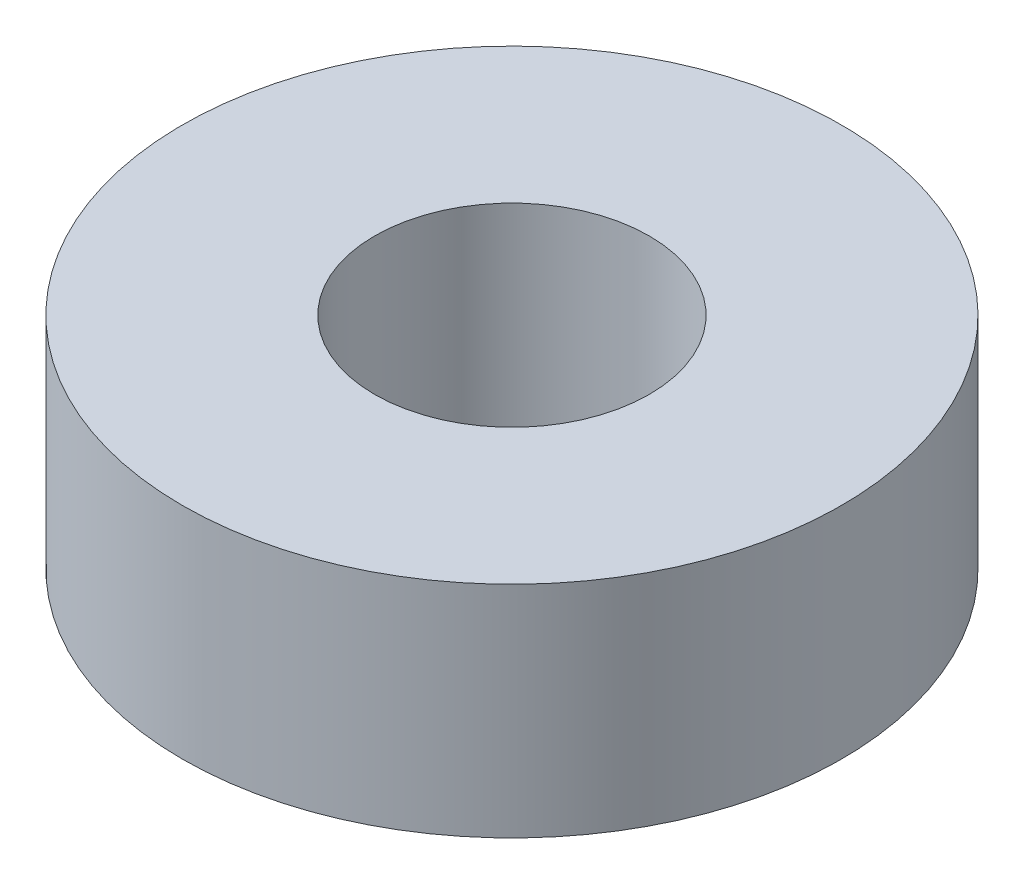
ISO-10303-21;
HEADER;
FILE_DESCRIPTION(('STEP AP214'),'2;1');
FILE_NAME('part.step','',(''),(''),'','','');
FILE_SCHEMA(('AUTOMOTIVE_DESIGN { 1 0 10303 214 1 1 1 1 }'));
ENDSEC;
DATA;
#1=APPLICATION_CONTEXT('core data for automotive mechanical design processes');
#2=APPLICATION_PROTOCOL_DEFINITION('international standard','automotive_design',2000,#1);
#3=PRODUCT_CONTEXT('',#1,'mechanical');
#4=PRODUCT('Part','Part','',(#3));
#5=PRODUCT_RELATED_PRODUCT_CATEGORY('part','',(#4));
#6=PRODUCT_DEFINITION_FORMATION('','',#4);
#7=PRODUCT_DEFINITION_CONTEXT('part definition',#1,'design');
#8=PRODUCT_DEFINITION('design','',#6,#7);
#9=PRODUCT_DEFINITION_SHAPE('','',#8);
#10=(LENGTH_UNIT() NAMED_UNIT(*) SI_UNIT(.MILLI.,.METRE.));
#11=(NAMED_UNIT(*) PLANE_ANGLE_UNIT() SI_UNIT($,.RADIAN.));
#12=(NAMED_UNIT(*) SI_UNIT($,.STERADIAN.) SOLID_ANGLE_UNIT());
#13=UNCERTAINTY_MEASURE_WITH_UNIT(LENGTH_MEASURE(1.E-05),#10,'distance_accuracy_value','');
#14=(GEOMETRIC_REPRESENTATION_CONTEXT(3) GLOBAL_UNCERTAINTY_ASSIGNED_CONTEXT((#13)) GLOBAL_UNIT_ASSIGNED_CONTEXT((#10,
#11,#12)) REPRESENTATION_CONTEXT('',''));
#15=CARTESIAN_POINT('',(0.,0.,0.));
#16=DIRECTION('',(0.,0.,1.));
#17=DIRECTION('',(1.,0.,0.));
#18=AXIS2_PLACEMENT_3D('',#15,#16,#17);
#19=CARTESIAN_POINT('',(0.,4.,0.));
#20=DIRECTION('',(0.,1.,0.));
#21=DIRECTION('',(0.,0.,1.));
#22=AXIS2_PLACEMENT_3D('',#19,#20,#21);
#23=PLANE('',#22);
#24=CARTESIAN_POINT('',(0.,4.,0.));
#25=DIRECTION('',(0.,1.,0.));
#26=DIRECTION('',(0.,0.,1.));
#27=AXIS2_PLACEMENT_3D('',#24,#25,#26);
#28=CIRCLE('',#27,6.);
#29=CARTESIAN_POINT('',(0.,4.,6.));
#30=VERTEX_POINT('',#29);
#31=EDGE_CURVE('E10',#30,#30,#28,.T.);
#32=ORIENTED_EDGE('',*,*,#31,.T.);
#33=EDGE_LOOP('',(#32));
#34=FACE_BOUND('',#33,.T.);
#35=CARTESIAN_POINT('',(0.,4.,0.));
#36=DIRECTION('',(0.,1.,0.));
#37=DIRECTION('',(0.,0.,1.));
#38=AXIS2_PLACEMENT_3D('',#35,#36,#37);
#39=CIRCLE('',#38,2.5);
#40=CARTESIAN_POINT('',(0.,4.,2.5));
#41=VERTEX_POINT('',#40);
#42=EDGE_CURVE('E41',#41,#41,#39,.T.);
#43=ORIENTED_EDGE('',*,*,#42,.F.);
#44=EDGE_LOOP('',(#43));
#45=FACE_BOUND('',#44,.T.);
#46=ADVANCED_FACE('F30',(#34,#45),#23,.T.);
#47=CARTESIAN_POINT('',(0.,0.,0.));
#48=DIRECTION('',(0.,1.,0.));
#49=DIRECTION('',(0.,0.,1.));
#50=AXIS2_PLACEMENT_3D('',#47,#48,#49);
#51=PLANE('',#50);
#52=CARTESIAN_POINT('',(0.,0.,0.));
#53=DIRECTION('',(0.,1.,0.));
#54=DIRECTION('',(0.,0.,1.));
#55=AXIS2_PLACEMENT_3D('',#52,#53,#54);
#56=CIRCLE('',#55,6.);
#57=CARTESIAN_POINT('',(0.,0.,6.));
#58=VERTEX_POINT('',#57);
#59=EDGE_CURVE('E34',#58,#58,#56,.T.);
#60=ORIENTED_EDGE('',*,*,#59,.F.);
#61=EDGE_LOOP('',(#60));
#62=FACE_BOUND('',#61,.T.);
#63=CARTESIAN_POINT('',(0.,0.,0.));
#64=DIRECTION('',(0.,1.,0.));
#65=DIRECTION('',(0.,0.,1.));
#66=AXIS2_PLACEMENT_3D('',#63,#64,#65);
#67=CIRCLE('',#66,2.5);
#68=CARTESIAN_POINT('',(0.,0.,2.5));
#69=VERTEX_POINT('',#68);
#70=EDGE_CURVE('E43',#69,#69,#67,.T.);
#71=ORIENTED_EDGE('',*,*,#70,.T.);
#72=EDGE_LOOP('',(#71));
#73=FACE_BOUND('',#72,.T.);
#74=ADVANCED_FACE('F53',(#62,#73),#51,.F.);
#75=CARTESIAN_POINT('',(0.,4.,0.));
#76=DIRECTION('',(0.,-1.,0.));
#77=DIRECTION('',(0.,0.,-1.));
#78=AXIS2_PLACEMENT_3D('',#75,#76,#77);
#79=CYLINDRICAL_SURFACE('',#78,6.);
#80=ORIENTED_EDGE('',*,*,#31,.F.);
#81=EDGE_LOOP('',(#80));
#82=FACE_BOUND('',#81,.T.);
#83=ORIENTED_EDGE('',*,*,#59,.T.);
#84=EDGE_LOOP('',(#83));
#85=FACE_BOUND('',#84,.T.);
#86=ADVANCED_FACE('F32',(#82,#85),#79,.T.);
#87=CARTESIAN_POINT('',(0.,4.,0.));
#88=DIRECTION('',(0.,-1.,0.));
#89=DIRECTION('',(0.,0.,-1.));
#90=AXIS2_PLACEMENT_3D('',#87,#88,#89);
#91=CYLINDRICAL_SURFACE('',#90,2.5);
#92=ORIENTED_EDGE('',*,*,#42,.T.);
#93=EDGE_LOOP('',(#92));
#94=FACE_BOUND('',#93,.T.);
#95=ORIENTED_EDGE('',*,*,#70,.F.);
#96=EDGE_LOOP('',(#95));
#97=FACE_BOUND('',#96,.T.);
#98=ADVANCED_FACE('F49',(#94,#97),#91,.F.);
#99=CLOSED_SHELL('',(#46,#74,#86,#98));
#100=MANIFOLD_SOLID_BREP('B2',#99);
#101=ADVANCED_BREP_SHAPE_REPRESENTATION('',(#18,#100),#14);
#102=SHAPE_DEFINITION_REPRESENTATION(#9,#101);
ENDSEC;
END-ISO-10303-21;
